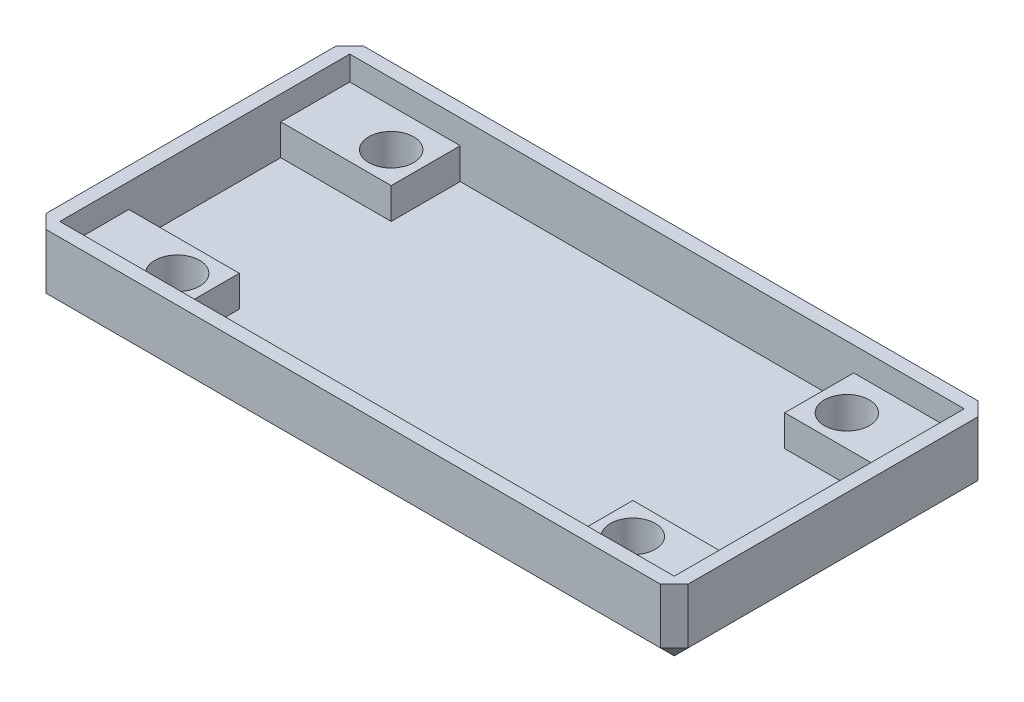
ISO-10303-21;
HEADER;
FILE_DESCRIPTION(('STEP AP214'),'2;1');
FILE_NAME('part.step','',(''),(''),'','','');
FILE_SCHEMA(('AUTOMOTIVE_DESIGN { 1 0 10303 214 1 1 1 1 }'));
ENDSEC;
DATA;
#1=APPLICATION_CONTEXT('core data for automotive mechanical design processes');
#2=APPLICATION_PROTOCOL_DEFINITION('international standard','automotive_design',2000,#1);
#3=PRODUCT_CONTEXT('',#1,'mechanical');
#4=PRODUCT('Part','Part','',(#3));
#5=PRODUCT_RELATED_PRODUCT_CATEGORY('part','',(#4));
#6=PRODUCT_DEFINITION_FORMATION('','',#4);
#7=PRODUCT_DEFINITION_CONTEXT('part definition',#1,'design');
#8=PRODUCT_DEFINITION('design','',#6,#7);
#9=PRODUCT_DEFINITION_SHAPE('','',#8);
#10=(LENGTH_UNIT() NAMED_UNIT(*) SI_UNIT(.MILLI.,.METRE.));
#11=(NAMED_UNIT(*) PLANE_ANGLE_UNIT() SI_UNIT($,.RADIAN.));
#12=(NAMED_UNIT(*) SI_UNIT($,.STERADIAN.) SOLID_ANGLE_UNIT());
#13=UNCERTAINTY_MEASURE_WITH_UNIT(LENGTH_MEASURE(1.E-05),#10,'distance_accuracy_value','');
#14=(GEOMETRIC_REPRESENTATION_CONTEXT(3) GLOBAL_UNCERTAINTY_ASSIGNED_CONTEXT((#13)) GLOBAL_UNIT_ASSIGNED_CONTEXT((#10,
#11,#12)) REPRESENTATION_CONTEXT('',''));
#15=CARTESIAN_POINT('',(0.,0.,0.));
#16=DIRECTION('',(0.,0.,1.));
#17=DIRECTION('',(1.,0.,0.));
#18=AXIS2_PLACEMENT_3D('',#15,#16,#17);
#19=CARTESIAN_POINT('',(0.,1.,0.));
#20=DIRECTION('',(0.,-1.,0.));
#21=DIRECTION('',(0.,0.,-1.));
#22=AXIS2_PLACEMENT_3D('',#19,#20,#21);
#23=PLANE('',#22);
#24=DIRECTION('',(0.,0.,-1.));
#25=VECTOR('',#24,1.);
#26=CARTESIAN_POINT('',(-14.25,1.,10.5));
#27=LINE('',#26,#25);
#28=CARTESIAN_POINT('',(-14.25,1.,10.5));
#29=VERTEX_POINT('',#28);
#30=CARTESIAN_POINT('',(-14.25,1.,5.5));
#31=VERTEX_POINT('',#30);
#32=EDGE_CURVE('E439',#29,#31,#27,.T.);
#33=ORIENTED_EDGE('',*,*,#32,.F.);
#34=DIRECTION('',(1.,0.,0.));
#35=VECTOR('',#34,1.);
#36=CARTESIAN_POINT('',(-22.25,1.,10.5));
#37=LINE('',#36,#35);
#38=CARTESIAN_POINT('',(14.25,1.,10.5));
#39=VERTEX_POINT('',#38);
#40=EDGE_CURVE('E236',#29,#39,#37,.T.);
#41=ORIENTED_EDGE('',*,*,#40,.T.);
#42=DIRECTION('',(0.,0.,1.));
#43=VECTOR('',#42,1.);
#44=CARTESIAN_POINT('',(14.25,1.,10.5));
#45=LINE('',#44,#43);
#46=CARTESIAN_POINT('',(14.25,1.,5.5));
#47=VERTEX_POINT('',#46);
#48=EDGE_CURVE('E239',#47,#39,#45,.T.);
#49=ORIENTED_EDGE('',*,*,#48,.F.);
#50=DIRECTION('',(-1.,0.,0.));
#51=VECTOR('',#50,1.);
#52=CARTESIAN_POINT('',(22.25,1.,5.5));
#53=LINE('',#52,#51);
#54=CARTESIAN_POINT('',(22.25,1.,5.5));
#55=VERTEX_POINT('',#54);
#56=EDGE_CURVE('E237',#55,#47,#53,.T.);
#57=ORIENTED_EDGE('',*,*,#56,.F.);
#58=DIRECTION('',(0.,0.,-1.));
#59=VECTOR('',#58,1.);
#60=CARTESIAN_POINT('',(22.25,1.,10.5));
#61=LINE('',#60,#59);
#62=CARTESIAN_POINT('',(22.25,1.,-5.5));
#63=VERTEX_POINT('',#62);
#64=EDGE_CURVE('E314',#55,#63,#61,.T.);
#65=ORIENTED_EDGE('',*,*,#64,.T.);
#66=DIRECTION('',(1.,0.,0.));
#67=VECTOR('',#66,1.);
#68=CARTESIAN_POINT('',(22.25,1.,-5.5));
#69=LINE('',#68,#67);
#70=CARTESIAN_POINT('',(14.25,1.,-5.5));
#71=VERTEX_POINT('',#70);
#72=EDGE_CURVE('E269',#71,#63,#69,.T.);
#73=ORIENTED_EDGE('',*,*,#72,.F.);
#74=DIRECTION('',(0.,0.,1.));
#75=VECTOR('',#74,1.);
#76=CARTESIAN_POINT('',(14.25,1.,-10.5));
#77=LINE('',#76,#75);
#78=CARTESIAN_POINT('',(14.25,1.,-10.5));
#79=VERTEX_POINT('',#78);
#80=EDGE_CURVE('E264',#79,#71,#77,.T.);
#81=ORIENTED_EDGE('',*,*,#80,.F.);
#82=DIRECTION('',(-1.,0.,0.));
#83=VECTOR('',#82,1.);
#84=CARTESIAN_POINT('',(-22.25,1.,-10.5));
#85=LINE('',#84,#83);
#86=CARTESIAN_POINT('',(-14.25,1.,-10.5));
#87=VERTEX_POINT('',#86);
#88=EDGE_CURVE('E316',#79,#87,#85,.T.);
#89=ORIENTED_EDGE('',*,*,#88,.T.);
#90=DIRECTION('',(0.,0.,-1.));
#91=VECTOR('',#90,1.);
#92=CARTESIAN_POINT('',(-14.25,1.,-10.5));
#93=LINE('',#92,#91);
#94=CARTESIAN_POINT('',(-14.25,1.,-5.5));
#95=VERTEX_POINT('',#94);
#96=EDGE_CURVE('E292',#95,#87,#93,.T.);
#97=ORIENTED_EDGE('',*,*,#96,.F.);
#98=DIRECTION('',(1.,0.,0.));
#99=VECTOR('',#98,1.);
#100=CARTESIAN_POINT('',(-22.25,1.,-5.5));
#101=LINE('',#100,#99);
#102=CARTESIAN_POINT('',(-22.25,1.,-5.49999999999999));
#103=VERTEX_POINT('',#102);
#104=EDGE_CURVE('E287',#103,#95,#101,.T.);
#105=ORIENTED_EDGE('',*,*,#104,.F.);
#106=DIRECTION('',(0.,0.,1.));
#107=VECTOR('',#106,1.);
#108=CARTESIAN_POINT('',(-22.25,1.,10.5));
#109=LINE('',#108,#107);
#110=CARTESIAN_POINT('',(-22.25,1.,5.5));
#111=VERTEX_POINT('',#110);
#112=EDGE_CURVE('E319',#103,#111,#109,.T.);
#113=ORIENTED_EDGE('',*,*,#112,.T.);
#114=DIRECTION('',(-1.,0.,0.));
#115=VECTOR('',#114,1.);
#116=CARTESIAN_POINT('',(-22.25,1.,5.5));
#117=LINE('',#116,#115);
#118=EDGE_CURVE('E231',#31,#111,#117,.T.);
#119=ORIENTED_EDGE('',*,*,#118,.F.);
#120=EDGE_LOOP('',(#33,#41,#49,#57,#65,#73,#81,#89,#97,#105,#113,#119));
#121=FACE_BOUND('',#120,.T.);
#122=ADVANCED_FACE('F39',(#121),#23,.F.);
#123=CARTESIAN_POINT('',(-22.25,1.,10.5));
#124=DIRECTION('',(0.,0.,1.));
#125=DIRECTION('',(1.,0.,0.));
#126=AXIS2_PLACEMENT_3D('',#123,#124,#125);
#127=PLANE('',#126);
#128=DIRECTION('',(0.,-1.,0.));
#129=VECTOR('',#128,1.);
#130=CARTESIAN_POINT('',(-14.25,3.25,10.5));
#131=LINE('',#130,#129);
#132=CARTESIAN_POINT('',(-14.25,3.25,10.5));
#133=VERTEX_POINT('',#132);
#134=EDGE_CURVE('E215',#133,#29,#131,.T.);
#135=ORIENTED_EDGE('',*,*,#134,.F.);
#136=DIRECTION('',(1.,0.,0.));
#137=VECTOR('',#136,1.);
#138=CARTESIAN_POINT('',(-22.25,3.25,10.5));
#139=LINE('',#138,#137);
#140=CARTESIAN_POINT('',(-22.25,3.25,10.5));
#141=VERTEX_POINT('',#140);
#142=EDGE_CURVE('E223',#141,#133,#139,.T.);
#143=ORIENTED_EDGE('',*,*,#142,.F.);
#144=DIRECTION('',(0.,1.,0.));
#145=VECTOR('',#144,1.);
#146=CARTESIAN_POINT('',(-22.25,1.,10.5));
#147=LINE('',#146,#145);
#148=CARTESIAN_POINT('',(-22.25,5.,10.5));
#149=VERTEX_POINT('',#148);
#150=EDGE_CURVE('E337',#141,#149,#147,.T.);
#151=ORIENTED_EDGE('',*,*,#150,.T.);
#152=DIRECTION('',(1.,0.,0.));
#153=VECTOR('',#152,1.);
#154=CARTESIAN_POINT('',(-22.25,5.,10.5));
#155=LINE('',#154,#153);
#156=CARTESIAN_POINT('',(22.25,5.,10.5));
#157=VERTEX_POINT('',#156);
#158=EDGE_CURVE('E317',#149,#157,#155,.T.);
#159=ORIENTED_EDGE('',*,*,#158,.T.);
#160=DIRECTION('',(0.,1.,0.));
#161=VECTOR('',#160,1.);
#162=CARTESIAN_POINT('',(22.25,1.,10.5));
#163=LINE('',#162,#161);
#164=CARTESIAN_POINT('',(22.25,3.25,10.5));
#165=VERTEX_POINT('',#164);
#166=EDGE_CURVE('E334',#165,#157,#163,.T.);
#167=ORIENTED_EDGE('',*,*,#166,.F.);
#168=DIRECTION('',(1.,0.,0.));
#169=VECTOR('',#168,1.);
#170=CARTESIAN_POINT('',(22.25,3.25,10.5));
#171=LINE('',#170,#169);
#172=CARTESIAN_POINT('',(14.25,3.25,10.5));
#173=VERTEX_POINT('',#172);
#174=EDGE_CURVE('E253',#173,#165,#171,.T.);
#175=ORIENTED_EDGE('',*,*,#174,.F.);
#176=DIRECTION('',(0.,-1.,0.));
#177=VECTOR('',#176,1.);
#178=CARTESIAN_POINT('',(14.25,3.25,10.5));
#179=LINE('',#178,#177);
#180=EDGE_CURVE('E254',#173,#39,#179,.T.);
#181=ORIENTED_EDGE('',*,*,#180,.T.);
#182=ORIENTED_EDGE('',*,*,#40,.F.);
#183=EDGE_LOOP('',(#135,#143,#151,#159,#167,#175,#181,#182));
#184=FACE_BOUND('',#183,.T.);
#185=ADVANCED_FACE('F234',(#184),#127,.F.);
#186=CARTESIAN_POINT('',(-22.25,1.,10.5));
#187=DIRECTION('',(-1.,0.,0.));
#188=DIRECTION('',(0.,0.,1.));
#189=AXIS2_PLACEMENT_3D('',#186,#187,#188);
#190=PLANE('',#189);
#191=DIRECTION('',(0.,-1.,0.));
#192=VECTOR('',#191,1.);
#193=CARTESIAN_POINT('',(-22.25,3.25,5.5));
#194=LINE('',#193,#192);
#195=CARTESIAN_POINT('',(-22.25,3.25,5.5));
#196=VERTEX_POINT('',#195);
#197=EDGE_CURVE('E241',#196,#111,#194,.T.);
#198=ORIENTED_EDGE('',*,*,#197,.T.);
#199=ORIENTED_EDGE('',*,*,#112,.F.);
#200=DIRECTION('',(0.,-1.,0.));
#201=VECTOR('',#200,1.);
#202=CARTESIAN_POINT('',(-22.25,3.25,-5.5));
#203=LINE('',#202,#201);
#204=CARTESIAN_POINT('',(-22.25,3.25,-5.5));
#205=VERTEX_POINT('',#204);
#206=EDGE_CURVE('E310',#205,#103,#203,.T.);
#207=ORIENTED_EDGE('',*,*,#206,.F.);
#208=DIRECTION('',(0.,0.,1.));
#209=VECTOR('',#208,1.);
#210=CARTESIAN_POINT('',(-22.25,3.25,-10.5));
#211=LINE('',#210,#209);
#212=CARTESIAN_POINT('',(-22.25,3.25,-10.5));
#213=VERTEX_POINT('',#212);
#214=EDGE_CURVE('E288',#213,#205,#211,.T.);
#215=ORIENTED_EDGE('',*,*,#214,.F.);
#216=DIRECTION('',(0.,1.,0.));
#217=VECTOR('',#216,1.);
#218=CARTESIAN_POINT('',(-22.25,1.,-10.5));
#219=LINE('',#218,#217);
#220=CARTESIAN_POINT('',(-22.25,5.,-10.5));
#221=VERTEX_POINT('',#220);
#222=EDGE_CURVE('E339',#213,#221,#219,.T.);
#223=ORIENTED_EDGE('',*,*,#222,.T.);
#224=DIRECTION('',(0.,0.,1.));
#225=VECTOR('',#224,1.);
#226=CARTESIAN_POINT('',(-22.25,5.,10.5));
#227=LINE('',#226,#225);
#228=EDGE_CURVE('E329',#221,#149,#227,.T.);
#229=ORIENTED_EDGE('',*,*,#228,.T.);
#230=ORIENTED_EDGE('',*,*,#150,.F.);
#231=DIRECTION('',(0.,0.,1.));
#232=VECTOR('',#231,1.);
#233=CARTESIAN_POINT('',(-22.25,3.25,10.5));
#234=LINE('',#233,#232);
#235=EDGE_CURVE('E228',#196,#141,#234,.T.);
#236=ORIENTED_EDGE('',*,*,#235,.F.);
#237=EDGE_LOOP('',(#198,#199,#207,#215,#223,#229,#230,#236));
#238=FACE_BOUND('',#237,.T.);
#239=ADVANCED_FACE('F450',(#238),#190,.F.);
#240=CARTESIAN_POINT('',(22.25,1.,10.5));
#241=DIRECTION('',(1.,0.,0.));
#242=DIRECTION('',(0.,0.,-1.));
#243=AXIS2_PLACEMENT_3D('',#240,#241,#242);
#244=PLANE('',#243);
#245=DIRECTION('',(0.,-1.,0.));
#246=VECTOR('',#245,1.);
#247=CARTESIAN_POINT('',(22.25,3.25,5.5));
#248=LINE('',#247,#246);
#249=CARTESIAN_POINT('',(22.25,3.25,5.5));
#250=VERTEX_POINT('',#249);
#251=EDGE_CURVE('E262',#250,#55,#248,.T.);
#252=ORIENTED_EDGE('',*,*,#251,.F.);
#253=DIRECTION('',(0.,0.,-1.));
#254=VECTOR('',#253,1.);
#255=CARTESIAN_POINT('',(22.25,3.25,10.5));
#256=LINE('',#255,#254);
#257=EDGE_CURVE('E245',#165,#250,#256,.T.);
#258=ORIENTED_EDGE('',*,*,#257,.F.);
#259=ORIENTED_EDGE('',*,*,#166,.T.);
#260=DIRECTION('',(0.,0.,-1.));
#261=VECTOR('',#260,1.);
#262=CARTESIAN_POINT('',(22.25,5.,10.5));
#263=LINE('',#262,#261);
#264=CARTESIAN_POINT('',(22.25,5.,-10.5));
#265=VERTEX_POINT('',#264);
#266=EDGE_CURVE('E313',#157,#265,#263,.T.);
#267=ORIENTED_EDGE('',*,*,#266,.T.);
#268=DIRECTION('',(0.,1.,0.));
#269=VECTOR('',#268,1.);
#270=CARTESIAN_POINT('',(22.25,1.,-10.5));
#271=LINE('',#270,#269);
#272=CARTESIAN_POINT('',(22.25,3.25,-10.5));
#273=VERTEX_POINT('',#272);
#274=EDGE_CURVE('E323',#273,#265,#271,.T.);
#275=ORIENTED_EDGE('',*,*,#274,.F.);
#276=DIRECTION('',(0.,0.,-1.));
#277=VECTOR('',#276,1.);
#278=CARTESIAN_POINT('',(22.25,3.25,-10.5));
#279=LINE('',#278,#277);
#280=CARTESIAN_POINT('',(22.25,3.25,-5.5));
#281=VERTEX_POINT('',#280);
#282=EDGE_CURVE('E274',#281,#273,#279,.T.);
#283=ORIENTED_EDGE('',*,*,#282,.F.);
#284=DIRECTION('',(0.,-1.,0.));
#285=VECTOR('',#284,1.);
#286=CARTESIAN_POINT('',(22.25,3.25,-5.5));
#287=LINE('',#286,#285);
#288=EDGE_CURVE('E276',#281,#63,#287,.T.);
#289=ORIENTED_EDGE('',*,*,#288,.T.);
#290=ORIENTED_EDGE('',*,*,#64,.F.);
#291=EDGE_LOOP('',(#252,#258,#259,#267,#275,#283,#289,#290));
#292=FACE_BOUND('',#291,.T.);
#293=ADVANCED_FACE('F481',(#292),#244,.F.);
#294=CARTESIAN_POINT('',(-22.25,1.,-10.5));
#295=DIRECTION('',(0.,0.,-1.));
#296=DIRECTION('',(-1.,0.,0.));
#297=AXIS2_PLACEMENT_3D('',#294,#295,#296);
#298=PLANE('',#297);
#299=DIRECTION('',(0.,-1.,0.));
#300=VECTOR('',#299,1.);
#301=CARTESIAN_POINT('',(14.25,3.25,-10.5));
#302=LINE('',#301,#300);
#303=CARTESIAN_POINT('',(14.25,3.25,-10.5));
#304=VERTEX_POINT('',#303);
#305=EDGE_CURVE('E285',#304,#79,#302,.T.);
#306=ORIENTED_EDGE('',*,*,#305,.F.);
#307=DIRECTION('',(-1.,0.,0.));
#308=VECTOR('',#307,1.);
#309=CARTESIAN_POINT('',(22.25,3.25,-10.5));
#310=LINE('',#309,#308);
#311=EDGE_CURVE('E265',#273,#304,#310,.T.);
#312=ORIENTED_EDGE('',*,*,#311,.F.);
#313=ORIENTED_EDGE('',*,*,#274,.T.);
#314=DIRECTION('',(-1.,0.,0.));
#315=VECTOR('',#314,1.);
#316=CARTESIAN_POINT('',(-22.25,5.,-10.5));
#317=LINE('',#316,#315);
#318=EDGE_CURVE('E326',#265,#221,#317,.T.);
#319=ORIENTED_EDGE('',*,*,#318,.T.);
#320=ORIENTED_EDGE('',*,*,#222,.F.);
#321=DIRECTION('',(-1.,0.,0.));
#322=VECTOR('',#321,1.);
#323=CARTESIAN_POINT('',(-22.25,3.25,-10.5));
#324=LINE('',#323,#322);
#325=CARTESIAN_POINT('',(-14.25,3.25,-10.5));
#326=VERTEX_POINT('',#325);
#327=EDGE_CURVE('E297',#326,#213,#324,.T.);
#328=ORIENTED_EDGE('',*,*,#327,.F.);
#329=DIRECTION('',(0.,-1.,0.));
#330=VECTOR('',#329,1.);
#331=CARTESIAN_POINT('',(-14.25,3.25,-10.5));
#332=LINE('',#331,#330);
#333=EDGE_CURVE('E300',#326,#87,#332,.T.);
#334=ORIENTED_EDGE('',*,*,#333,.T.);
#335=ORIENTED_EDGE('',*,*,#88,.F.);
#336=EDGE_LOOP('',(#306,#312,#313,#319,#320,#328,#334,#335));
#337=FACE_BOUND('',#336,.T.);
#338=ADVANCED_FACE('F467',(#337),#298,.F.);
#339=CARTESIAN_POINT('',(23.25,5.,11.5));
#340=DIRECTION('',(-1.,0.,0.));
#341=DIRECTION('',(0.,0.,1.));
#342=AXIS2_PLACEMENT_3D('',#339,#340,#341);
#343=PLANE('',#342);
#344=DIRECTION('',(0.,0.,-1.));
#345=VECTOR('',#344,1.);
#346=CARTESIAN_POINT('',(23.25,1.,-11.5));
#347=LINE('',#346,#345);
#348=CARTESIAN_POINT('',(23.25,1.,10.5));
#349=VERTEX_POINT('',#348);
#350=CARTESIAN_POINT('',(23.25,1.,-10.5));
#351=VERTEX_POINT('',#350);
#352=EDGE_CURVE('E385',#349,#351,#347,.T.);
#353=ORIENTED_EDGE('',*,*,#352,.T.);
#354=DIRECTION('',(0.,1.,0.));
#355=VECTOR('',#354,1.);
#356=CARTESIAN_POINT('',(23.25,5.,-10.5));
#357=LINE('',#356,#355);
#358=CARTESIAN_POINT('',(23.25,5.,-10.5));
#359=VERTEX_POINT('',#358);
#360=EDGE_CURVE('E387',#351,#359,#357,.T.);
#361=ORIENTED_EDGE('',*,*,#360,.T.);
#362=DIRECTION('',(0.,0.,-1.));
#363=VECTOR('',#362,1.);
#364=CARTESIAN_POINT('',(23.25,5.,11.5));
#365=LINE('',#364,#363);
#366=CARTESIAN_POINT('',(23.25,5.,10.5));
#367=VERTEX_POINT('',#366);
#368=EDGE_CURVE('E336',#367,#359,#365,.T.);
#369=ORIENTED_EDGE('',*,*,#368,.F.);
#370=DIRECTION('',(0.,-1.,0.));
#371=VECTOR('',#370,1.);
#372=CARTESIAN_POINT('',(23.25,5.,10.5));
#373=LINE('',#372,#371);
#374=EDGE_CURVE('E383',#367,#349,#373,.T.);
#375=ORIENTED_EDGE('',*,*,#374,.T.);
#376=EDGE_LOOP('',(#353,#361,#369,#375));
#377=FACE_BOUND('',#376,.T.);
#378=ADVANCED_FACE('F517',(#377),#343,.F.);
#379=CARTESIAN_POINT('',(-23.25,5.,-11.5));
#380=DIRECTION('',(0.,0.,1.));
#381=DIRECTION('',(1.,0.,0.));
#382=AXIS2_PLACEMENT_3D('',#379,#380,#381);
#383=PLANE('',#382);
#384=DIRECTION('',(-1.,0.,0.));
#385=VECTOR('',#384,1.);
#386=CARTESIAN_POINT('',(-23.25,1.,-11.5));
#387=LINE('',#386,#385);
#388=CARTESIAN_POINT('',(22.25,1.,-11.5));
#389=VERTEX_POINT('',#388);
#390=CARTESIAN_POINT('',(-22.25,1.,-11.5));
#391=VERTEX_POINT('',#390);
#392=EDGE_CURVE('E355',#389,#391,#387,.T.);
#393=ORIENTED_EDGE('',*,*,#392,.T.);
#394=DIRECTION('',(0.,1.,0.));
#395=VECTOR('',#394,1.);
#396=CARTESIAN_POINT('',(-22.25,5.,-11.5));
#397=LINE('',#396,#395);
#398=CARTESIAN_POINT('',(-22.25,5.,-11.5));
#399=VERTEX_POINT('',#398);
#400=EDGE_CURVE('E358',#391,#399,#397,.T.);
#401=ORIENTED_EDGE('',*,*,#400,.T.);
#402=DIRECTION('',(-1.,0.,0.));
#403=VECTOR('',#402,1.);
#404=CARTESIAN_POINT('',(-23.25,5.,-11.5));
#405=LINE('',#404,#403);
#406=CARTESIAN_POINT('',(22.25,5.,-11.5));
#407=VERTEX_POINT('',#406);
#408=EDGE_CURVE('E344',#407,#399,#405,.T.);
#409=ORIENTED_EDGE('',*,*,#408,.F.);
#410=DIRECTION('',(0.,-1.,0.));
#411=VECTOR('',#410,1.);
#412=CARTESIAN_POINT('',(22.25,5.,-11.5));
#413=LINE('',#412,#411);
#414=EDGE_CURVE('E353',#407,#389,#413,.T.);
#415=ORIENTED_EDGE('',*,*,#414,.T.);
#416=EDGE_LOOP('',(#393,#401,#409,#415));
#417=FACE_BOUND('',#416,.T.);
#418=ADVANCED_FACE('F532',(#417),#383,.F.);
#419=CARTESIAN_POINT('',(-23.25,5.,11.5));
#420=DIRECTION('',(1.,0.,0.));
#421=DIRECTION('',(0.,0.,-1.));
#422=AXIS2_PLACEMENT_3D('',#419,#420,#421);
#423=PLANE('',#422);
#424=DIRECTION('',(0.,0.,1.));
#425=VECTOR('',#424,1.);
#426=CARTESIAN_POINT('',(-23.25,5.,11.5));
#427=LINE('',#426,#425);
#428=CARTESIAN_POINT('',(-23.25,5.,-10.5));
#429=VERTEX_POINT('',#428);
#430=CARTESIAN_POINT('',(-23.25,5.,10.5));
#431=VERTEX_POINT('',#430);
#432=EDGE_CURVE('E347',#429,#431,#427,.T.);
#433=ORIENTED_EDGE('',*,*,#432,.F.);
#434=DIRECTION('',(0.,-1.,0.));
#435=VECTOR('',#434,1.);
#436=CARTESIAN_POINT('',(-23.25,5.,-10.5));
#437=LINE('',#436,#435);
#438=CARTESIAN_POINT('',(-23.25,1.00000000000001,-10.5));
#439=VERTEX_POINT('',#438);
#440=EDGE_CURVE('E373',#429,#439,#437,.T.);
#441=ORIENTED_EDGE('',*,*,#440,.T.);
#442=DIRECTION('',(0.,0.,1.));
#443=VECTOR('',#442,1.);
#444=CARTESIAN_POINT('',(-23.25,1.00000000000001,11.5));
#445=LINE('',#444,#443);
#446=CARTESIAN_POINT('',(-23.25,1.00000000000001,10.5));
#447=VERTEX_POINT('',#446);
#448=EDGE_CURVE('E371',#439,#447,#445,.T.);
#449=ORIENTED_EDGE('',*,*,#448,.T.);
#450=DIRECTION('',(0.,1.,0.));
#451=VECTOR('',#450,1.);
#452=CARTESIAN_POINT('',(-23.25,5.,10.5));
#453=LINE('',#452,#451);
#454=EDGE_CURVE('E369',#447,#431,#453,.T.);
#455=ORIENTED_EDGE('',*,*,#454,.T.);
#456=EDGE_LOOP('',(#433,#441,#449,#455));
#457=FACE_BOUND('',#456,.T.);
#458=ADVANCED_FACE('F529',(#457),#423,.F.);
#459=CARTESIAN_POINT('',(-23.25,5.,11.5));
#460=DIRECTION('',(0.,0.,-1.));
#461=DIRECTION('',(-1.,0.,0.));
#462=AXIS2_PLACEMENT_3D('',#459,#460,#461);
#463=PLANE('',#462);
#464=DIRECTION('',(1.,0.,0.));
#465=VECTOR('',#464,1.);
#466=CARTESIAN_POINT('',(23.25,1.,11.5));
#467=LINE('',#466,#465);
#468=CARTESIAN_POINT('',(-22.25,1.,11.5));
#469=VERTEX_POINT('',#468);
#470=CARTESIAN_POINT('',(22.25,1.,11.5));
#471=VERTEX_POINT('',#470);
#472=EDGE_CURVE('E49',#469,#471,#467,.T.);
#473=ORIENTED_EDGE('',*,*,#472,.T.);
#474=DIRECTION('',(0.,1.,0.));
#475=VECTOR('',#474,1.);
#476=CARTESIAN_POINT('',(22.25,5.,11.5));
#477=LINE('',#476,#475);
#478=CARTESIAN_POINT('',(22.25,5.,11.5));
#479=VERTEX_POINT('',#478);
#480=EDGE_CURVE('E11',#471,#479,#477,.T.);
#481=ORIENTED_EDGE('',*,*,#480,.T.);
#482=DIRECTION('',(1.,0.,0.));
#483=VECTOR('',#482,1.);
#484=CARTESIAN_POINT('',(-23.25,5.,11.5));
#485=LINE('',#484,#483);
#486=CARTESIAN_POINT('',(-22.25,5.,11.5));
#487=VERTEX_POINT('',#486);
#488=EDGE_CURVE('E350',#487,#479,#485,.T.);
#489=ORIENTED_EDGE('',*,*,#488,.F.);
#490=DIRECTION('',(0.,-1.,0.));
#491=VECTOR('',#490,1.);
#492=CARTESIAN_POINT('',(-22.25,5.,11.5));
#493=LINE('',#492,#491);
#494=EDGE_CURVE('E60',#487,#469,#493,.T.);
#495=ORIENTED_EDGE('',*,*,#494,.T.);
#496=EDGE_LOOP('',(#473,#481,#489,#495));
#497=FACE_BOUND('',#496,.T.);
#498=ADVANCED_FACE('F523',(#497),#463,.F.);
#499=CARTESIAN_POINT('',(0.,5.,0.));
#500=DIRECTION('',(0.,-1.,0.));
#501=DIRECTION('',(0.,0.,-1.));
#502=AXIS2_PLACEMENT_3D('',#499,#500,#501);
#503=PLANE('',#502);
#504=ORIENTED_EDGE('',*,*,#318,.F.);
#505=ORIENTED_EDGE('',*,*,#266,.F.);
#506=ORIENTED_EDGE('',*,*,#158,.F.);
#507=ORIENTED_EDGE('',*,*,#228,.F.);
#508=EDGE_LOOP('',(#504,#505,#506,#507));
#509=FACE_BOUND('',#508,.T.);
#510=ORIENTED_EDGE('',*,*,#408,.T.);
#511=DIRECTION('',(0.707106781186545,0.,-0.70710678118655));
#512=VECTOR('',#511,1.);
#513=CARTESIAN_POINT('',(-23.25,5.,-10.5));
#514=LINE('',#513,#512);
#515=EDGE_CURVE('E381',#399,#429,#514,.F.);
#516=ORIENTED_EDGE('',*,*,#515,.T.);
#517=ORIENTED_EDGE('',*,*,#432,.T.);
#518=DIRECTION('',(-0.707106781186545,0.,-0.70710678118655));
#519=VECTOR('',#518,1.);
#520=CARTESIAN_POINT('',(-22.25,5.,11.5));
#521=LINE('',#520,#519);
#522=EDGE_CURVE('E375',#431,#487,#521,.F.);
#523=ORIENTED_EDGE('',*,*,#522,.T.);
#524=ORIENTED_EDGE('',*,*,#488,.T.);
#525=DIRECTION('',(-0.707106781186545,0.,0.70710678118655));
#526=VECTOR('',#525,1.);
#527=CARTESIAN_POINT('',(23.25,5.,10.5));
#528=LINE('',#527,#526);
#529=EDGE_CURVE('E377',#479,#367,#528,.F.);
#530=ORIENTED_EDGE('',*,*,#529,.T.);
#531=ORIENTED_EDGE('',*,*,#368,.T.);
#532=DIRECTION('',(0.707106781186545,0.,0.70710678118655));
#533=VECTOR('',#532,1.);
#534=CARTESIAN_POINT('',(22.25,5.,-11.5));
#535=LINE('',#534,#533);
#536=EDGE_CURVE('E379',#359,#407,#535,.F.);
#537=ORIENTED_EDGE('',*,*,#536,.T.);
#538=EDGE_LOOP('',(#510,#516,#517,#523,#524,#530,#531,#537));
#539=FACE_BOUND('',#538,.T.);
#540=ADVANCED_FACE('F475',(#509,#539),#503,.F.);
#541=CARTESIAN_POINT('',(0.,0.,0.));
#542=DIRECTION('',(0.,-1.,0.));
#543=DIRECTION('',(0.,0.,-1.));
#544=AXIS2_PLACEMENT_3D('',#541,#542,#543);
#545=PLANE('',#544);
#546=DIRECTION('',(0.,0.,-1.));
#547=VECTOR('',#546,1.);
#548=CARTESIAN_POINT('',(-22.25,0.,-11.5));
#549=LINE('',#548,#547);
#550=CARTESIAN_POINT('',(-22.25,0.,10.5));
#551=VERTEX_POINT('',#550);
#552=CARTESIAN_POINT('',(-22.25,0.,-10.5));
#553=VERTEX_POINT('',#552);
#554=EDGE_CURVE('E364',#551,#553,#549,.T.);
#555=ORIENTED_EDGE('',*,*,#554,.T.);
#556=DIRECTION('',(1.,0.,0.));
#557=VECTOR('',#556,1.);
#558=CARTESIAN_POINT('',(23.25,0.,-10.5));
#559=LINE('',#558,#557);
#560=CARTESIAN_POINT('',(22.25,0.,-10.5));
#561=VERTEX_POINT('',#560);
#562=EDGE_CURVE('E366',#553,#561,#559,.T.);
#563=ORIENTED_EDGE('',*,*,#562,.T.);
#564=DIRECTION('',(0.,0.,1.));
#565=VECTOR('',#564,1.);
#566=CARTESIAN_POINT('',(22.25,0.,11.5));
#567=LINE('',#566,#565);
#568=CARTESIAN_POINT('',(22.25,0.,10.5));
#569=VERTEX_POINT('',#568);
#570=EDGE_CURVE('E362',#561,#569,#567,.T.);
#571=ORIENTED_EDGE('',*,*,#570,.T.);
#572=DIRECTION('',(-1.,0.,0.));
#573=VECTOR('',#572,1.);
#574=CARTESIAN_POINT('',(-23.25,0.,10.5));
#575=LINE('',#574,#573);
#576=EDGE_CURVE('E360',#569,#551,#575,.T.);
#577=ORIENTED_EDGE('',*,*,#576,.T.);
#578=EDGE_LOOP('',(#555,#563,#571,#577));
#579=FACE_BOUND('',#578,.T.);
#580=CARTESIAN_POINT('',(-16.5,0.,7.75));
#581=DIRECTION('',(0.,1.,0.));
#582=DIRECTION('',(0.,0.,-1.));
#583=AXIS2_PLACEMENT_3D('',#580,#581,#582);
#584=CIRCLE('',#583,1.625);
#585=CARTESIAN_POINT('',(-16.5,0.,6.125));
#586=VERTEX_POINT('',#585);
#587=EDGE_CURVE('E427',#586,#586,#584,.T.);
#588=ORIENTED_EDGE('',*,*,#587,.T.);
#589=EDGE_LOOP('',(#588));
#590=FACE_BOUND('',#589,.T.);
#591=CARTESIAN_POINT('',(16.5,0.,7.75));
#592=DIRECTION('',(0.,1.,0.));
#593=DIRECTION('',(0.,0.,1.));
#594=AXIS2_PLACEMENT_3D('',#591,#592,#593);
#595=CIRCLE('',#594,1.625);
#596=CARTESIAN_POINT('',(16.5,0.,9.375));
#597=VERTEX_POINT('',#596);
#598=EDGE_CURVE('E654',#597,#597,#595,.T.);
#599=ORIENTED_EDGE('',*,*,#598,.T.);
#600=EDGE_LOOP('',(#599));
#601=FACE_BOUND('',#600,.T.);
#602=CARTESIAN_POINT('',(16.5,0.,-7.75));
#603=DIRECTION('',(0.,1.,0.));
#604=DIRECTION('',(0.,0.,-1.));
#605=AXIS2_PLACEMENT_3D('',#602,#603,#604);
#606=CIRCLE('',#605,1.625);
#607=CARTESIAN_POINT('',(16.5,0.,-9.375));
#608=VERTEX_POINT('',#607);
#609=EDGE_CURVE('E442',#608,#608,#606,.T.);
#610=ORIENTED_EDGE('',*,*,#609,.T.);
#611=EDGE_LOOP('',(#610));
#612=FACE_BOUND('',#611,.T.);
#613=CARTESIAN_POINT('',(-16.5,0.,-7.75));
#614=DIRECTION('',(0.,1.,0.));
#615=DIRECTION('',(0.,0.,1.));
#616=AXIS2_PLACEMENT_3D('',#613,#614,#615);
#617=CIRCLE('',#616,1.625);
#618=CARTESIAN_POINT('',(-16.5,0.,-6.125));
#619=VERTEX_POINT('',#618);
#620=EDGE_CURVE('E436',#619,#619,#617,.T.);
#621=ORIENTED_EDGE('',*,*,#620,.T.);
#622=EDGE_LOOP('',(#621));
#623=FACE_BOUND('',#622,.T.);
#624=ADVANCED_FACE('F522',(#579,#590,#601,#612,#623),#545,.T.);
#625=CARTESIAN_POINT('',(-22.25,3.25,-5.5));
#626=DIRECTION('',(0.,0.,-1.));
#627=DIRECTION('',(-1.,0.,0.));
#628=AXIS2_PLACEMENT_3D('',#625,#626,#627);
#629=PLANE('',#628);
#630=ORIENTED_EDGE('',*,*,#104,.T.);
#631=DIRECTION('',(0.,-1.,0.));
#632=VECTOR('',#631,1.);
#633=CARTESIAN_POINT('',(-14.25,3.25,-5.5));
#634=LINE('',#633,#632);
#635=CARTESIAN_POINT('',(-14.25,3.25,-5.5));
#636=VERTEX_POINT('',#635);
#637=EDGE_CURVE('E307',#636,#95,#634,.T.);
#638=ORIENTED_EDGE('',*,*,#637,.F.);
#639=DIRECTION('',(1.,0.,0.));
#640=VECTOR('',#639,1.);
#641=CARTESIAN_POINT('',(-22.25,3.25,-5.5));
#642=LINE('',#641,#640);
#643=EDGE_CURVE('E291',#205,#636,#642,.T.);
#644=ORIENTED_EDGE('',*,*,#643,.F.);
#645=ORIENTED_EDGE('',*,*,#206,.T.);
#646=EDGE_LOOP('',(#630,#638,#644,#645));
#647=FACE_BOUND('',#646,.T.);
#648=ADVANCED_FACE('F456',(#647),#629,.F.);
#649=CARTESIAN_POINT('',(-14.25,3.25,-10.5));
#650=DIRECTION('',(-1.,0.,0.));
#651=DIRECTION('',(0.,0.,1.));
#652=AXIS2_PLACEMENT_3D('',#649,#650,#651);
#653=PLANE('',#652);
#654=ORIENTED_EDGE('',*,*,#96,.T.);
#655=ORIENTED_EDGE('',*,*,#333,.F.);
#656=DIRECTION('',(0.,0.,-1.));
#657=VECTOR('',#656,1.);
#658=CARTESIAN_POINT('',(-14.25,3.25,-10.5));
#659=LINE('',#658,#657);
#660=EDGE_CURVE('E294',#636,#326,#659,.T.);
#661=ORIENTED_EDGE('',*,*,#660,.F.);
#662=ORIENTED_EDGE('',*,*,#637,.T.);
#663=EDGE_LOOP('',(#654,#655,#661,#662));
#664=FACE_BOUND('',#663,.T.);
#665=ADVANCED_FACE('F460',(#664),#653,.F.);
#666=CARTESIAN_POINT('',(0.,3.25,0.));
#667=DIRECTION('',(0.,1.,0.));
#668=DIRECTION('',(0.,0.,1.));
#669=AXIS2_PLACEMENT_3D('',#666,#667,#668);
#670=PLANE('',#669);
#671=CARTESIAN_POINT('',(-16.5,3.25,-7.75));
#672=DIRECTION('',(0.,1.,0.));
#673=DIRECTION('',(0.,0.,1.));
#674=AXIS2_PLACEMENT_3D('',#671,#672,#673);
#675=CIRCLE('',#674,1.625);
#676=CARTESIAN_POINT('',(-16.5,3.25,-6.125));
#677=VERTEX_POINT('',#676);
#678=EDGE_CURVE('E440',#677,#677,#675,.T.);
#679=ORIENTED_EDGE('',*,*,#678,.F.);
#680=EDGE_LOOP('',(#679));
#681=FACE_BOUND('',#680,.T.);
#682=ORIENTED_EDGE('',*,*,#214,.T.);
#683=ORIENTED_EDGE('',*,*,#643,.T.);
#684=ORIENTED_EDGE('',*,*,#660,.T.);
#685=ORIENTED_EDGE('',*,*,#327,.T.);
#686=EDGE_LOOP('',(#682,#683,#684,#685));
#687=FACE_BOUND('',#686,.T.);
#688=ADVANCED_FACE('F463',(#681,#687),#670,.T.);
#689=CARTESIAN_POINT('',(14.25,3.25,-10.5));
#690=DIRECTION('',(1.,0.,0.));
#691=DIRECTION('',(0.,0.,-1.));
#692=AXIS2_PLACEMENT_3D('',#689,#690,#691);
#693=PLANE('',#692);
#694=ORIENTED_EDGE('',*,*,#80,.T.);
#695=DIRECTION('',(0.,-1.,0.));
#696=VECTOR('',#695,1.);
#697=CARTESIAN_POINT('',(14.25,3.25,-5.5));
#698=LINE('',#697,#696);
#699=CARTESIAN_POINT('',(14.25,3.25,-5.5));
#700=VERTEX_POINT('',#699);
#701=EDGE_CURVE('E282',#700,#71,#698,.T.);
#702=ORIENTED_EDGE('',*,*,#701,.F.);
#703=DIRECTION('',(0.,0.,1.));
#704=VECTOR('',#703,1.);
#705=CARTESIAN_POINT('',(14.25,3.25,-10.5));
#706=LINE('',#705,#704);
#707=EDGE_CURVE('E268',#304,#700,#706,.T.);
#708=ORIENTED_EDGE('',*,*,#707,.F.);
#709=ORIENTED_EDGE('',*,*,#305,.T.);
#710=EDGE_LOOP('',(#694,#702,#708,#709));
#711=FACE_BOUND('',#710,.T.);
#712=ADVANCED_FACE('F667',(#711),#693,.F.);
#713=CARTESIAN_POINT('',(22.25,3.25,-5.5));
#714=DIRECTION('',(0.,0.,-1.));
#715=DIRECTION('',(-1.,0.,0.));
#716=AXIS2_PLACEMENT_3D('',#713,#714,#715);
#717=PLANE('',#716);
#718=ORIENTED_EDGE('',*,*,#72,.T.);
#719=ORIENTED_EDGE('',*,*,#288,.F.);
#720=DIRECTION('',(1.,0.,0.));
#721=VECTOR('',#720,1.);
#722=CARTESIAN_POINT('',(22.25,3.25,-5.5));
#723=LINE('',#722,#721);
#724=EDGE_CURVE('E271',#700,#281,#723,.T.);
#725=ORIENTED_EDGE('',*,*,#724,.F.);
#726=ORIENTED_EDGE('',*,*,#701,.T.);
#727=EDGE_LOOP('',(#718,#719,#725,#726));
#728=FACE_BOUND('',#727,.T.);
#729=ADVANCED_FACE('F673',(#728),#717,.F.);
#730=CARTESIAN_POINT('',(0.,3.25,0.));
#731=DIRECTION('',(0.,1.,0.));
#732=DIRECTION('',(0.,0.,1.));
#733=AXIS2_PLACEMENT_3D('',#730,#731,#732);
#734=PLANE('',#733);
#735=CARTESIAN_POINT('',(16.5,3.25,-7.75));
#736=DIRECTION('',(0.,1.,0.));
#737=DIRECTION('',(0.,0.,-1.));
#738=AXIS2_PLACEMENT_3D('',#735,#736,#737);
#739=CIRCLE('',#738,1.625);
#740=CARTESIAN_POINT('',(16.5,3.25,-9.375));
#741=VERTEX_POINT('',#740);
#742=EDGE_CURVE('E697',#741,#741,#739,.T.);
#743=ORIENTED_EDGE('',*,*,#742,.F.);
#744=EDGE_LOOP('',(#743));
#745=FACE_BOUND('',#744,.T.);
#746=ORIENTED_EDGE('',*,*,#311,.T.);
#747=ORIENTED_EDGE('',*,*,#707,.T.);
#748=ORIENTED_EDGE('',*,*,#724,.T.);
#749=ORIENTED_EDGE('',*,*,#282,.T.);
#750=EDGE_LOOP('',(#746,#747,#748,#749));
#751=FACE_BOUND('',#750,.T.);
#752=ADVANCED_FACE('F679',(#745,#751),#734,.T.);
#753=CARTESIAN_POINT('',(22.25,3.25,5.5));
#754=DIRECTION('',(0.,0.,1.));
#755=DIRECTION('',(1.,0.,0.));
#756=AXIS2_PLACEMENT_3D('',#753,#754,#755);
#757=PLANE('',#756);
#758=ORIENTED_EDGE('',*,*,#56,.T.);
#759=DIRECTION('',(0.,-1.,0.));
#760=VECTOR('',#759,1.);
#761=CARTESIAN_POINT('',(14.25,3.25,5.5));
#762=LINE('',#761,#760);
#763=CARTESIAN_POINT('',(14.25,3.25,5.5));
#764=VERTEX_POINT('',#763);
#765=EDGE_CURVE('E259',#764,#47,#762,.T.);
#766=ORIENTED_EDGE('',*,*,#765,.F.);
#767=DIRECTION('',(-1.,0.,0.));
#768=VECTOR('',#767,1.);
#769=CARTESIAN_POINT('',(22.25,3.25,5.5));
#770=LINE('',#769,#768);
#771=EDGE_CURVE('E248',#250,#764,#770,.T.);
#772=ORIENTED_EDGE('',*,*,#771,.F.);
#773=ORIENTED_EDGE('',*,*,#251,.T.);
#774=EDGE_LOOP('',(#758,#766,#772,#773));
#775=FACE_BOUND('',#774,.T.);
#776=ADVANCED_FACE('F683',(#775),#757,.F.);
#777=CARTESIAN_POINT('',(14.25,3.25,10.5));
#778=DIRECTION('',(1.,0.,0.));
#779=DIRECTION('',(0.,0.,-1.));
#780=AXIS2_PLACEMENT_3D('',#777,#778,#779);
#781=PLANE('',#780);
#782=ORIENTED_EDGE('',*,*,#48,.T.);
#783=ORIENTED_EDGE('',*,*,#180,.F.);
#784=DIRECTION('',(0.,0.,1.));
#785=VECTOR('',#784,1.);
#786=CARTESIAN_POINT('',(14.25,3.25,10.5));
#787=LINE('',#786,#785);
#788=EDGE_CURVE('E250',#764,#173,#787,.T.);
#789=ORIENTED_EDGE('',*,*,#788,.F.);
#790=ORIENTED_EDGE('',*,*,#765,.T.);
#791=EDGE_LOOP('',(#782,#783,#789,#790));
#792=FACE_BOUND('',#791,.T.);
#793=ADVANCED_FACE('F490',(#792),#781,.F.);
#794=CARTESIAN_POINT('',(0.,3.25,0.));
#795=DIRECTION('',(0.,1.,0.));
#796=DIRECTION('',(0.,0.,1.));
#797=AXIS2_PLACEMENT_3D('',#794,#795,#796);
#798=PLANE('',#797);
#799=CARTESIAN_POINT('',(16.5,3.25,7.75));
#800=DIRECTION('',(0.,1.,0.));
#801=DIRECTION('',(0.,0.,1.));
#802=AXIS2_PLACEMENT_3D('',#799,#800,#801);
#803=CIRCLE('',#802,1.625);
#804=CARTESIAN_POINT('',(16.5,3.25,9.375));
#805=VERTEX_POINT('',#804);
#806=EDGE_CURVE('E432',#805,#805,#803,.T.);
#807=ORIENTED_EDGE('',*,*,#806,.F.);
#808=EDGE_LOOP('',(#807));
#809=FACE_BOUND('',#808,.T.);
#810=ORIENTED_EDGE('',*,*,#257,.T.);
#811=ORIENTED_EDGE('',*,*,#771,.T.);
#812=ORIENTED_EDGE('',*,*,#788,.T.);
#813=ORIENTED_EDGE('',*,*,#174,.T.);
#814=EDGE_LOOP('',(#810,#811,#812,#813));
#815=FACE_BOUND('',#814,.T.);
#816=ADVANCED_FACE('F486',(#809,#815),#798,.T.);
#817=CARTESIAN_POINT('',(-14.25,3.25,10.5));
#818=DIRECTION('',(-1.,0.,0.));
#819=DIRECTION('',(0.,0.,1.));
#820=AXIS2_PLACEMENT_3D('',#817,#818,#819);
#821=PLANE('',#820);
#822=ORIENTED_EDGE('',*,*,#32,.T.);
#823=DIRECTION('',(0.,-1.,0.));
#824=VECTOR('',#823,1.);
#825=CARTESIAN_POINT('',(-14.25,3.25,5.5));
#826=LINE('',#825,#824);
#827=CARTESIAN_POINT('',(-14.25,3.25,5.5));
#828=VERTEX_POINT('',#827);
#829=EDGE_CURVE('E218',#828,#31,#826,.T.);
#830=ORIENTED_EDGE('',*,*,#829,.F.);
#831=DIRECTION('',(0.,0.,-1.));
#832=VECTOR('',#831,1.);
#833=CARTESIAN_POINT('',(-14.25,3.25,10.5));
#834=LINE('',#833,#832);
#835=EDGE_CURVE('E211',#133,#828,#834,.T.);
#836=ORIENTED_EDGE('',*,*,#835,.F.);
#837=ORIENTED_EDGE('',*,*,#134,.T.);
#838=EDGE_LOOP('',(#822,#830,#836,#837));
#839=FACE_BOUND('',#838,.T.);
#840=ADVANCED_FACE('F213',(#839),#821,.F.);
#841=CARTESIAN_POINT('',(-22.25,3.25,5.5));
#842=DIRECTION('',(0.,0.,1.));
#843=DIRECTION('',(1.,0.,0.));
#844=AXIS2_PLACEMENT_3D('',#841,#842,#843);
#845=PLANE('',#844);
#846=ORIENTED_EDGE('',*,*,#118,.T.);
#847=ORIENTED_EDGE('',*,*,#197,.F.);
#848=DIRECTION('',(-1.,0.,0.));
#849=VECTOR('',#848,1.);
#850=CARTESIAN_POINT('',(-22.25,3.25,5.5));
#851=LINE('',#850,#849);
#852=EDGE_CURVE('E222',#828,#196,#851,.T.);
#853=ORIENTED_EDGE('',*,*,#852,.F.);
#854=ORIENTED_EDGE('',*,*,#829,.T.);
#855=EDGE_LOOP('',(#846,#847,#853,#854));
#856=FACE_BOUND('',#855,.T.);
#857=ADVANCED_FACE('F493',(#856),#845,.F.);
#858=CARTESIAN_POINT('',(0.,3.25,0.));
#859=DIRECTION('',(0.,1.,0.));
#860=DIRECTION('',(0.,0.,1.));
#861=AXIS2_PLACEMENT_3D('',#858,#859,#860);
#862=PLANE('',#861);
#863=CARTESIAN_POINT('',(-16.5,3.25,7.75));
#864=DIRECTION('',(0.,1.,0.));
#865=DIRECTION('',(0.,0.,-1.));
#866=AXIS2_PLACEMENT_3D('',#863,#864,#865);
#867=CIRCLE('',#866,1.625);
#868=CARTESIAN_POINT('',(-16.5,3.25,6.125));
#869=VERTEX_POINT('',#868);
#870=EDGE_CURVE('E424',#869,#869,#867,.T.);
#871=ORIENTED_EDGE('',*,*,#870,.F.);
#872=EDGE_LOOP('',(#871));
#873=FACE_BOUND('',#872,.T.);
#874=ORIENTED_EDGE('',*,*,#142,.T.);
#875=ORIENTED_EDGE('',*,*,#835,.T.);
#876=ORIENTED_EDGE('',*,*,#852,.T.);
#877=ORIENTED_EDGE('',*,*,#235,.T.);
#878=EDGE_LOOP('',(#874,#875,#876,#877));
#879=FACE_BOUND('',#878,.T.);
#880=ADVANCED_FACE('F226',(#873,#879),#862,.T.);
#881=CARTESIAN_POINT('',(-16.5,0.,7.75));
#882=DIRECTION('',(0.,1.,0.));
#883=DIRECTION('',(0.,0.,1.));
#884=AXIS2_PLACEMENT_3D('',#881,#882,#883);
#885=CYLINDRICAL_SURFACE('',#884,1.625);
#886=ORIENTED_EDGE('',*,*,#587,.F.);
#887=EDGE_LOOP('',(#886));
#888=FACE_BOUND('',#887,.T.);
#889=ORIENTED_EDGE('',*,*,#870,.T.);
#890=EDGE_LOOP('',(#889));
#891=FACE_BOUND('',#890,.T.);
#892=ADVANCED_FACE('F500',(#888,#891),#885,.F.);
#893=CARTESIAN_POINT('',(16.5,0.,7.75));
#894=DIRECTION('',(0.,1.,0.));
#895=DIRECTION('',(0.,0.,1.));
#896=AXIS2_PLACEMENT_3D('',#893,#894,#895);
#897=CYLINDRICAL_SURFACE('',#896,1.625);
#898=ORIENTED_EDGE('',*,*,#598,.F.);
#899=EDGE_LOOP('',(#898));
#900=FACE_BOUND('',#899,.T.);
#901=ORIENTED_EDGE('',*,*,#806,.T.);
#902=EDGE_LOOP('',(#901));
#903=FACE_BOUND('',#902,.T.);
#904=ADVANCED_FACE('F711',(#900,#903),#897,.F.);
#905=CARTESIAN_POINT('',(16.5,0.,-7.75));
#906=DIRECTION('',(0.,1.,0.));
#907=DIRECTION('',(0.,0.,1.));
#908=AXIS2_PLACEMENT_3D('',#905,#906,#907);
#909=CYLINDRICAL_SURFACE('',#908,1.625);
#910=ORIENTED_EDGE('',*,*,#609,.F.);
#911=EDGE_LOOP('',(#910));
#912=FACE_BOUND('',#911,.T.);
#913=ORIENTED_EDGE('',*,*,#742,.T.);
#914=EDGE_LOOP('',(#913));
#915=FACE_BOUND('',#914,.T.);
#916=ADVANCED_FACE('F662',(#912,#915),#909,.F.);
#917=CARTESIAN_POINT('',(-16.5,0.,-7.75));
#918=DIRECTION('',(0.,1.,0.));
#919=DIRECTION('',(0.,0.,1.));
#920=AXIS2_PLACEMENT_3D('',#917,#918,#919);
#921=CYLINDRICAL_SURFACE('',#920,1.625);
#922=ORIENTED_EDGE('',*,*,#620,.F.);
#923=EDGE_LOOP('',(#922));
#924=FACE_BOUND('',#923,.T.);
#925=ORIENTED_EDGE('',*,*,#678,.T.);
#926=EDGE_LOOP('',(#925));
#927=FACE_BOUND('',#926,.T.);
#928=ADVANCED_FACE('F617',(#924,#927),#921,.F.);
#929=CARTESIAN_POINT('',(23.25,5.,10.5));
#930=DIRECTION('',(-0.70710678118655,0.,-0.707106781186545));
#931=DIRECTION('',(0.,-1.,0.));
#932=AXIS2_PLACEMENT_3D('',#929,#930,#931);
#933=PLANE('',#932);
#934=ORIENTED_EDGE('',*,*,#529,.F.);
#935=ORIENTED_EDGE('',*,*,#480,.F.);
#936=DIRECTION('',(0.707106781186545,0.,-0.70710678118655));
#937=VECTOR('',#936,1.);
#938=CARTESIAN_POINT('',(22.75,1.,11.));
#939=LINE('',#938,#937);
#940=EDGE_CURVE('E418',#349,#471,#939,.F.);
#941=ORIENTED_EDGE('',*,*,#940,.F.);
#942=ORIENTED_EDGE('',*,*,#374,.F.);
#943=EDGE_LOOP('',(#934,#935,#941,#942));
#944=FACE_BOUND('',#943,.T.);
#945=ADVANCED_FACE('F42',(#944),#933,.F.);
#946=CARTESIAN_POINT('',(-22.25,5.,11.5));
#947=DIRECTION('',(0.70710678118655,0.,-0.707106781186545));
#948=DIRECTION('',(0.,-1.,0.));
#949=AXIS2_PLACEMENT_3D('',#946,#947,#948);
#950=PLANE('',#949);
#951=ORIENTED_EDGE('',*,*,#522,.F.);
#952=ORIENTED_EDGE('',*,*,#454,.F.);
#953=DIRECTION('',(0.707106781186545,0.,0.70710678118655));
#954=VECTOR('',#953,1.);
#955=CARTESIAN_POINT('',(-23.25,1.00000000000001,10.5));
#956=LINE('',#955,#954);
#957=EDGE_CURVE('E416',#469,#447,#956,.F.);
#958=ORIENTED_EDGE('',*,*,#957,.F.);
#959=ORIENTED_EDGE('',*,*,#494,.F.);
#960=EDGE_LOOP('',(#951,#952,#958,#959));
#961=FACE_BOUND('',#960,.T.);
#962=ADVANCED_FACE('F608',(#961),#950,.F.);
#963=CARTESIAN_POINT('',(-23.25,1.,11.5));
#964=DIRECTION('',(0.,-0.70710678118655,0.707106781186545));
#965=DIRECTION('',(-1.,0.,0.));
#966=AXIS2_PLACEMENT_3D('',#963,#964,#965);
#967=PLANE('',#966);
#968=DIRECTION('',(0.,-0.707106781186545,-0.70710678118655));
#969=VECTOR('',#968,1.);
#970=CARTESIAN_POINT('',(22.25,0.,10.5));
#971=LINE('',#970,#969);
#972=EDGE_CURVE('E44',#471,#569,#971,.T.);
#973=ORIENTED_EDGE('',*,*,#972,.F.);
#974=ORIENTED_EDGE('',*,*,#472,.F.);
#975=DIRECTION('',(0.,0.707106781186545,0.70710678118655));
#976=VECTOR('',#975,1.);
#977=CARTESIAN_POINT('',(-22.25,0.500000000000001,11.));
#978=LINE('',#977,#976);
#979=EDGE_CURVE('E413',#551,#469,#978,.T.);
#980=ORIENTED_EDGE('',*,*,#979,.F.);
#981=ORIENTED_EDGE('',*,*,#576,.F.);
#982=EDGE_LOOP('',(#973,#974,#980,#981));
#983=FACE_BOUND('',#982,.T.);
#984=ADVANCED_FACE('F603',(#983),#967,.T.);
#985=CARTESIAN_POINT('',(22.25,0.,10.5));
#986=DIRECTION('',(0.577350269189626,-0.57735026918963,0.577350269189622));
#987=DIRECTION('',(0.70710678118655,0.707106781186545,0.));
#988=AXIS2_PLACEMENT_3D('',#985,#986,#987);
#989=PLANE('',#988);
#990=ORIENTED_EDGE('',*,*,#940,.T.);
#991=ORIENTED_EDGE('',*,*,#972,.T.);
#992=DIRECTION('',(0.70710678118655,0.707106781186545,0.));
#993=VECTOR('',#992,1.);
#994=CARTESIAN_POINT('',(22.25,0.,10.5));
#995=LINE('',#994,#993);
#996=EDGE_CURVE('E410',#349,#569,#995,.F.);
#997=ORIENTED_EDGE('',*,*,#996,.F.);
#998=EDGE_LOOP('',(#990,#991,#997));
#999=FACE_BOUND('',#998,.T.);
#1000=ADVANCED_FACE('F596',(#999),#989,.T.);
#1001=CARTESIAN_POINT('',(-23.25,1.00000000000001,10.5));
#1002=DIRECTION('',(-0.57735026918963,-0.577350269189626,0.577350269189622));
#1003=DIRECTION('',(0.707106781186545,-0.70710678118655,0.));
#1004=AXIS2_PLACEMENT_3D('',#1001,#1002,#1003);
#1005=PLANE('',#1004);
#1006=ORIENTED_EDGE('',*,*,#979,.T.);
#1007=ORIENTED_EDGE('',*,*,#957,.T.);
#1008=DIRECTION('',(0.707106781186545,-0.70710678118655,0.));
#1009=VECTOR('',#1008,1.);
#1010=CARTESIAN_POINT('',(-23.25,1.00000000000001,10.5));
#1011=LINE('',#1010,#1009);
#1012=EDGE_CURVE('E407',#551,#447,#1011,.F.);
#1013=ORIENTED_EDGE('',*,*,#1012,.F.);
#1014=EDGE_LOOP('',(#1006,#1007,#1013));
#1015=FACE_BOUND('',#1014,.T.);
#1016=ADVANCED_FACE('F589',(#1015),#1005,.T.);
#1017=CARTESIAN_POINT('',(23.25,1.,11.5));
#1018=DIRECTION('',(0.707106781186545,-0.70710678118655,0.));
#1019=DIRECTION('',(0.,0.,1.));
#1020=AXIS2_PLACEMENT_3D('',#1017,#1018,#1019);
#1021=PLANE('',#1020);
#1022=ORIENTED_EDGE('',*,*,#996,.T.);
#1023=ORIENTED_EDGE('',*,*,#570,.F.);
#1024=DIRECTION('',(-0.70710678118655,-0.707106781186545,0.));
#1025=VECTOR('',#1024,1.);
#1026=CARTESIAN_POINT('',(22.25,0.,-10.5));
#1027=LINE('',#1026,#1025);
#1028=EDGE_CURVE('E404',#351,#561,#1027,.T.);
#1029=ORIENTED_EDGE('',*,*,#1028,.F.);
#1030=ORIENTED_EDGE('',*,*,#352,.F.);
#1031=EDGE_LOOP('',(#1022,#1023,#1029,#1030));
#1032=FACE_BOUND('',#1031,.T.);
#1033=ADVANCED_FACE('F582',(#1032),#1021,.T.);
#1034=CARTESIAN_POINT('',(22.25,5.,-11.5));
#1035=DIRECTION('',(-0.70710678118655,0.,0.707106781186545));
#1036=DIRECTION('',(0.,-1.,0.));
#1037=AXIS2_PLACEMENT_3D('',#1034,#1035,#1036);
#1038=PLANE('',#1037);
#1039=ORIENTED_EDGE('',*,*,#536,.F.);
#1040=ORIENTED_EDGE('',*,*,#360,.F.);
#1041=DIRECTION('',(-0.707106781186545,0.,-0.70710678118655));
#1042=VECTOR('',#1041,1.);
#1043=CARTESIAN_POINT('',(22.75,1.,-11.));
#1044=LINE('',#1043,#1042);
#1045=EDGE_CURVE('E401',#389,#351,#1044,.F.);
#1046=ORIENTED_EDGE('',*,*,#1045,.F.);
#1047=ORIENTED_EDGE('',*,*,#414,.F.);
#1048=EDGE_LOOP('',(#1039,#1040,#1046,#1047));
#1049=FACE_BOUND('',#1048,.T.);
#1050=ADVANCED_FACE('F575',(#1049),#1038,.F.);
#1051=CARTESIAN_POINT('',(-23.25,5.,-10.5));
#1052=DIRECTION('',(0.70710678118655,0.,0.707106781186545));
#1053=DIRECTION('',(0.,-1.,0.));
#1054=AXIS2_PLACEMENT_3D('',#1051,#1052,#1053);
#1055=PLANE('',#1054);
#1056=ORIENTED_EDGE('',*,*,#515,.F.);
#1057=ORIENTED_EDGE('',*,*,#400,.F.);
#1058=DIRECTION('',(-0.707106781186545,0.,0.70710678118655));
#1059=VECTOR('',#1058,1.);
#1060=CARTESIAN_POINT('',(-22.25,1.,-11.5));
#1061=LINE('',#1060,#1059);
#1062=EDGE_CURVE('E398',#439,#391,#1061,.F.);
#1063=ORIENTED_EDGE('',*,*,#1062,.F.);
#1064=ORIENTED_EDGE('',*,*,#440,.F.);
#1065=EDGE_LOOP('',(#1056,#1057,#1063,#1064));
#1066=FACE_BOUND('',#1065,.T.);
#1067=ADVANCED_FACE('F568',(#1066),#1055,.F.);
#1068=CARTESIAN_POINT('',(-23.25,1.00000000000001,11.5));
#1069=DIRECTION('',(-0.70710678118655,-0.707106781186545,0.));
#1070=DIRECTION('',(0.,0.,-1.));
#1071=AXIS2_PLACEMENT_3D('',#1068,#1069,#1070);
#1072=PLANE('',#1071);
#1073=ORIENTED_EDGE('',*,*,#1012,.T.);
#1074=ORIENTED_EDGE('',*,*,#448,.F.);
#1075=DIRECTION('',(-0.707106781186545,0.70710678118655,0.));
#1076=VECTOR('',#1075,1.);
#1077=CARTESIAN_POINT('',(-22.75,0.500000000000004,-10.5));
#1078=LINE('',#1077,#1076);
#1079=EDGE_CURVE('E395',#553,#439,#1078,.T.);
#1080=ORIENTED_EDGE('',*,*,#1079,.F.);
#1081=ORIENTED_EDGE('',*,*,#554,.F.);
#1082=EDGE_LOOP('',(#1073,#1074,#1080,#1081));
#1083=FACE_BOUND('',#1082,.T.);
#1084=ADVANCED_FACE('F561',(#1083),#1072,.T.);
#1085=CARTESIAN_POINT('',(22.25,0.,-10.5));
#1086=DIRECTION('',(0.577350269189626,-0.57735026918963,-0.577350269189622));
#1087=DIRECTION('',(0.70710678118655,0.707106781186545,0.));
#1088=AXIS2_PLACEMENT_3D('',#1085,#1086,#1087);
#1089=PLANE('',#1088);
#1090=ORIENTED_EDGE('',*,*,#1045,.T.);
#1091=ORIENTED_EDGE('',*,*,#1028,.T.);
#1092=DIRECTION('',(0.,0.707106781186545,-0.70710678118655));
#1093=VECTOR('',#1092,1.);
#1094=CARTESIAN_POINT('',(22.25,0.,-10.5));
#1095=LINE('',#1094,#1093);
#1096=EDGE_CURVE('E393',#389,#561,#1095,.F.);
#1097=ORIENTED_EDGE('',*,*,#1096,.F.);
#1098=EDGE_LOOP('',(#1090,#1091,#1097));
#1099=FACE_BOUND('',#1098,.T.);
#1100=ADVANCED_FACE('F554',(#1099),#1089,.T.);
#1101=CARTESIAN_POINT('',(-22.25,1.,-11.5));
#1102=DIRECTION('',(-0.57735026918963,-0.577350269189626,-0.577350269189622));
#1103=DIRECTION('',(0.707106781186545,-0.70710678118655,0.));
#1104=AXIS2_PLACEMENT_3D('',#1101,#1102,#1103);
#1105=PLANE('',#1104);
#1106=ORIENTED_EDGE('',*,*,#1079,.T.);
#1107=ORIENTED_EDGE('',*,*,#1062,.T.);
#1108=DIRECTION('',(0.,-0.707106781186545,0.70710678118655));
#1109=VECTOR('',#1108,1.);
#1110=CARTESIAN_POINT('',(-22.25,1.,-11.5));
#1111=LINE('',#1110,#1109);
#1112=EDGE_CURVE('E391',#553,#391,#1111,.F.);
#1113=ORIENTED_EDGE('',*,*,#1112,.F.);
#1114=EDGE_LOOP('',(#1106,#1107,#1113));
#1115=FACE_BOUND('',#1114,.T.);
#1116=ADVANCED_FACE('F547',(#1115),#1105,.T.);
#1117=CARTESIAN_POINT('',(-23.25,1.,-11.5));
#1118=DIRECTION('',(0.,-0.70710678118655,-0.707106781186545));
#1119=DIRECTION('',(1.,0.,0.));
#1120=AXIS2_PLACEMENT_3D('',#1117,#1118,#1119);
#1121=PLANE('',#1120);
#1122=ORIENTED_EDGE('',*,*,#1096,.T.);
#1123=ORIENTED_EDGE('',*,*,#562,.F.);
#1124=ORIENTED_EDGE('',*,*,#1112,.T.);
#1125=ORIENTED_EDGE('',*,*,#392,.F.);
#1126=EDGE_LOOP('',(#1122,#1123,#1124,#1125));
#1127=FACE_BOUND('',#1126,.T.);
#1128=ADVANCED_FACE('F541',(#1127),#1121,.T.);
#1129=CLOSED_SHELL('',(#122,#185,#239,#293,#338,#378,#418,#458,#498,#540,#624,#648,#665,#688,
#712,#729,#752,#776,#793,#816,#840,#857,#880,#892,#904,#916,#928,#945,#962,#984,#1000,#1016,
#1033,#1050,#1067,#1084,#1100,#1116,#1128));
#1130=MANIFOLD_SOLID_BREP('B2',#1129);
#1131=ADVANCED_BREP_SHAPE_REPRESENTATION('',(#18,#1130),#14);
#1132=SHAPE_DEFINITION_REPRESENTATION(#9,#1131);
ENDSEC;
END-ISO-10303-21;
